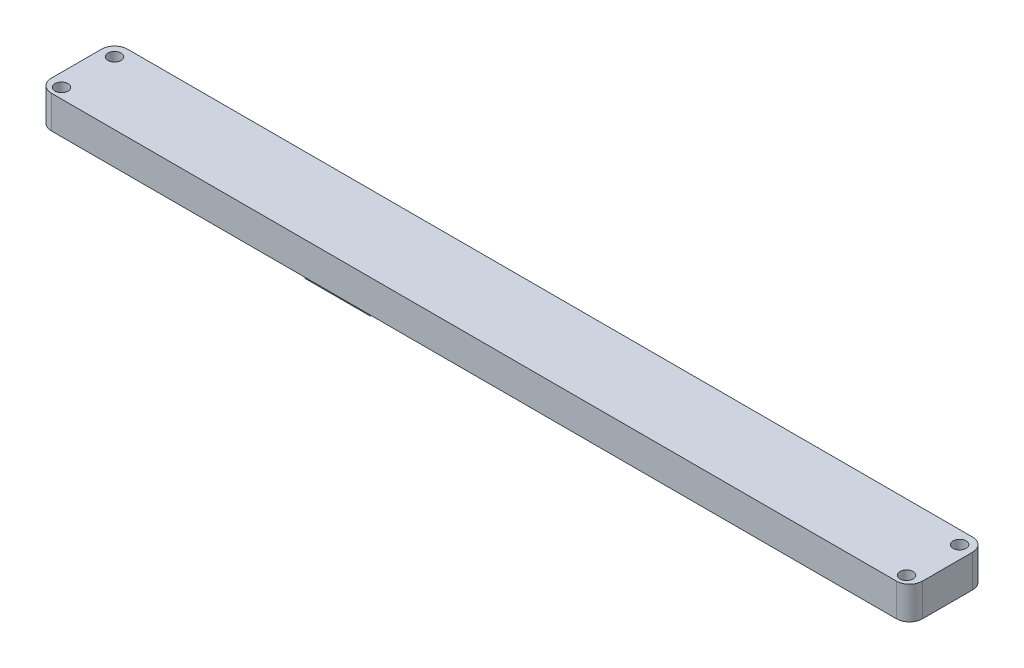
ISO-10303-21;
HEADER;
FILE_DESCRIPTION(('STEP AP214'),'2;1');
FILE_NAME('part.step','',(''),(''),'','','');
FILE_SCHEMA(('AUTOMOTIVE_DESIGN { 1 0 10303 214 1 1 1 1 }'));
ENDSEC;
DATA;
#1=APPLICATION_CONTEXT('core data for automotive mechanical design processes');
#2=APPLICATION_PROTOCOL_DEFINITION('international standard','automotive_design',2000,#1);
#3=PRODUCT_CONTEXT('',#1,'mechanical');
#4=PRODUCT('Part','Part','',(#3));
#5=PRODUCT_RELATED_PRODUCT_CATEGORY('part','',(#4));
#6=PRODUCT_DEFINITION_FORMATION('','',#4);
#7=PRODUCT_DEFINITION_CONTEXT('part definition',#1,'design');
#8=PRODUCT_DEFINITION('design','',#6,#7);
#9=PRODUCT_DEFINITION_SHAPE('','',#8);
#10=(LENGTH_UNIT() NAMED_UNIT(*) SI_UNIT(.MILLI.,.METRE.));
#11=(NAMED_UNIT(*) PLANE_ANGLE_UNIT() SI_UNIT($,.RADIAN.));
#12=(NAMED_UNIT(*) SI_UNIT($,.STERADIAN.) SOLID_ANGLE_UNIT());
#13=UNCERTAINTY_MEASURE_WITH_UNIT(LENGTH_MEASURE(1.E-05),#10,'distance_accuracy_value','');
#14=(GEOMETRIC_REPRESENTATION_CONTEXT(3) GLOBAL_UNCERTAINTY_ASSIGNED_CONTEXT((#13)) GLOBAL_UNIT_ASSIGNED_CONTEXT((#10,
#11,#12)) REPRESENTATION_CONTEXT('',''));
#15=CARTESIAN_POINT('',(0.,0.,0.));
#16=DIRECTION('',(0.,0.,1.));
#17=DIRECTION('',(1.,0.,0.));
#18=AXIS2_PLACEMENT_3D('',#15,#16,#17);
#19=CARTESIAN_POINT('',(194.,0.,-11.5));
#20=DIRECTION('',(0.,-1.,0.));
#21=DIRECTION('',(0.,0.,-1.));
#22=AXIS2_PLACEMENT_3D('',#19,#20,#21);
#23=PLANE('',#22);
#24=CARTESIAN_POINT('',(-194.,0.,12.8432745424898));
#25=DIRECTION('',(0.,1.,0.));
#26=DIRECTION('',(0.,0.,1.));
#27=AXIS2_PLACEMENT_3D('',#24,#25,#26);
#28=CIRCLE('',#27,2.99999999999999);
#29=CARTESIAN_POINT('',(-194.,0.,15.8432745424898));
#30=VERTEX_POINT('',#29);
#31=EDGE_CURVE('E206',#30,#30,#28,.T.);
#32=ORIENTED_EDGE('',*,*,#31,.T.);
#33=EDGE_LOOP('',(#32));
#34=FACE_BOUND('',#33,.T.);
#35=CARTESIAN_POINT('',(194.,0.,-11.5));
#36=DIRECTION('',(0.,1.,0.));
#37=DIRECTION('',(0.,0.,1.));
#38=AXIS2_PLACEMENT_3D('',#35,#36,#37);
#39=CIRCLE('',#38,2.99999999999999);
#40=CARTESIAN_POINT('',(194.,0.,-8.50000000000001));
#41=VERTEX_POINT('',#40);
#42=EDGE_CURVE('E212',#41,#41,#39,.T.);
#43=ORIENTED_EDGE('',*,*,#42,.T.);
#44=EDGE_LOOP('',(#43));
#45=FACE_BOUND('',#44,.T.);
#46=CARTESIAN_POINT('',(194.,0.,-11.5));
#47=DIRECTION('',(0.,1.,0.));
#48=DIRECTION('',(0.,0.,-1.));
#49=AXIS2_PLACEMENT_3D('',#46,#47,#48);
#50=CIRCLE('',#49,6.);
#51=CARTESIAN_POINT('',(200.,0.,-11.5));
#52=VERTEX_POINT('',#51);
#53=CARTESIAN_POINT('',(194.,0.,-17.5));
#54=VERTEX_POINT('',#53);
#55=EDGE_CURVE('E215',#52,#54,#50,.T.);
#56=ORIENTED_EDGE('',*,*,#55,.F.);
#57=DIRECTION('',(0.,0.,-1.));
#58=VECTOR('',#57,1.);
#59=CARTESIAN_POINT('',(200.,0.,11.5));
#60=LINE('',#59,#58);
#61=CARTESIAN_POINT('',(200.,0.,11.5));
#62=VERTEX_POINT('',#61);
#63=EDGE_CURVE('E153',#62,#52,#60,.T.);
#64=ORIENTED_EDGE('',*,*,#63,.F.);
#65=CARTESIAN_POINT('',(194.,0.,11.5));
#66=DIRECTION('',(0.,1.,0.));
#67=DIRECTION('',(0.,0.,1.));
#68=AXIS2_PLACEMENT_3D('',#65,#66,#67);
#69=CIRCLE('',#68,6.);
#70=CARTESIAN_POINT('',(194.,0.,17.5));
#71=VERTEX_POINT('',#70);
#72=EDGE_CURVE('E159',#71,#62,#69,.T.);
#73=ORIENTED_EDGE('',*,*,#72,.F.);
#74=DIRECTION('',(1.,0.,0.));
#75=VECTOR('',#74,1.);
#76=CARTESIAN_POINT('',(-194.,0.,17.5));
#77=LINE('',#76,#75);
#78=CARTESIAN_POINT('',(-194.,0.,17.5));
#79=VERTEX_POINT('',#78);
#80=EDGE_CURVE('E229',#79,#71,#77,.T.);
#81=ORIENTED_EDGE('',*,*,#80,.F.);
#82=CARTESIAN_POINT('',(-194.,0.,11.5));
#83=DIRECTION('',(0.,1.,0.));
#84=DIRECTION('',(0.,0.,-1.));
#85=AXIS2_PLACEMENT_3D('',#82,#83,#84);
#86=CIRCLE('',#85,6.);
#87=CARTESIAN_POINT('',(-200.,0.,11.5));
#88=VERTEX_POINT('',#87);
#89=EDGE_CURVE('E226',#88,#79,#86,.T.);
#90=ORIENTED_EDGE('',*,*,#89,.F.);
#91=DIRECTION('',(0.,0.,1.));
#92=VECTOR('',#91,1.);
#93=CARTESIAN_POINT('',(-200.,0.,11.5));
#94=LINE('',#93,#92);
#95=CARTESIAN_POINT('',(-200.,0.,-11.5));
#96=VERTEX_POINT('',#95);
#97=EDGE_CURVE('E223',#96,#88,#94,.T.);
#98=ORIENTED_EDGE('',*,*,#97,.F.);
#99=CARTESIAN_POINT('',(-194.,0.,-11.5));
#100=DIRECTION('',(0.,1.,0.));
#101=DIRECTION('',(0.,0.,-1.));
#102=AXIS2_PLACEMENT_3D('',#99,#100,#101);
#103=CIRCLE('',#102,6.);
#104=CARTESIAN_POINT('',(-194.,0.,-17.5));
#105=VERTEX_POINT('',#104);
#106=EDGE_CURVE('E220',#105,#96,#103,.T.);
#107=ORIENTED_EDGE('',*,*,#106,.F.);
#108=DIRECTION('',(-1.,0.,0.));
#109=VECTOR('',#108,1.);
#110=CARTESIAN_POINT('',(-194.,0.,-17.5));
#111=LINE('',#110,#109);
#112=EDGE_CURVE('E217',#54,#105,#111,.T.);
#113=ORIENTED_EDGE('',*,*,#112,.F.);
#114=EDGE_LOOP('',(#56,#64,#73,#81,#90,#98,#107,#113));
#115=FACE_BOUND('',#114,.T.);
#116=CARTESIAN_POINT('',(194.,0.,12.8432745424898));
#117=DIRECTION('',(0.,1.,0.));
#118=DIRECTION('',(0.,0.,1.));
#119=AXIS2_PLACEMENT_3D('',#116,#117,#118);
#120=CIRCLE('',#119,2.99999999999999);
#121=CARTESIAN_POINT('',(194.,0.,15.8432745424898));
#122=VERTEX_POINT('',#121);
#123=EDGE_CURVE('E209',#122,#122,#120,.T.);
#124=ORIENTED_EDGE('',*,*,#123,.T.);
#125=EDGE_LOOP('',(#124));
#126=FACE_BOUND('',#125,.T.);
#127=CARTESIAN_POINT('',(-194.,0.,-11.5));
#128=DIRECTION('',(0.,1.,0.));
#129=DIRECTION('',(0.,0.,1.));
#130=AXIS2_PLACEMENT_3D('',#127,#128,#129);
#131=CIRCLE('',#130,2.99999999999999);
#132=CARTESIAN_POINT('',(-194.,0.,-8.50000000000001));
#133=VERTEX_POINT('',#132);
#134=EDGE_CURVE('E203',#133,#133,#131,.T.);
#135=ORIENTED_EDGE('',*,*,#134,.T.);
#136=EDGE_LOOP('',(#135));
#137=FACE_BOUND('',#136,.T.);
#138=DIRECTION('',(1.,0.,0.));
#139=VECTOR('',#138,1.);
#140=CARTESIAN_POINT('',(-83.0933507684873,0.,-13.0826787847727));
#141=LINE('',#140,#139);
#142=CARTESIAN_POINT('',(-92.258502158399,0.,-13.0826787847727));
#143=VERTEX_POINT('',#142);
#144=CARTESIAN_POINT('',(-43.9281993785756,0.,-13.0826787847727));
#145=VERTEX_POINT('',#144);
#146=EDGE_CURVE('E69',#143,#145,#141,.T.);
#147=ORIENTED_EDGE('',*,*,#146,.F.);
#148=DIRECTION('',(0.,0.,1.));
#149=VECTOR('',#148,1.);
#150=CARTESIAN_POINT('',(-92.258502158399,0.,11.9173212152273));
#151=LINE('',#150,#149);
#152=CARTESIAN_POINT('',(-92.258502158399,0.,11.9173212152273));
#153=VERTEX_POINT('',#152);
#154=EDGE_CURVE('E175',#143,#153,#151,.T.);
#155=ORIENTED_EDGE('',*,*,#154,.T.);
#156=DIRECTION('',(-1.,0.,0.));
#157=VECTOR('',#156,1.);
#158=CARTESIAN_POINT('',(-83.0933507684873,0.,11.9173212152273));
#159=LINE('',#158,#157);
#160=CARTESIAN_POINT('',(-43.9281993785756,0.,11.9173212152273));
#161=VERTEX_POINT('',#160);
#162=EDGE_CURVE('E186',#161,#153,#159,.T.);
#163=ORIENTED_EDGE('',*,*,#162,.F.);
#164=DIRECTION('',(0.,0.,-1.));
#165=VECTOR('',#164,1.);
#166=CARTESIAN_POINT('',(-43.9281993785756,0.,-13.0826787847727));
#167=LINE('',#166,#165);
#168=EDGE_CURVE('E173',#161,#145,#167,.T.);
#169=ORIENTED_EDGE('',*,*,#168,.T.);
#170=EDGE_LOOP('',(#147,#155,#163,#169));
#171=FACE_BOUND('',#170,.T.);
#172=ADVANCED_FACE('F45',(#34,#45,#115,#126,#137,#171),#23,.T.);
#173=CARTESIAN_POINT('',(194.,36.,-11.5));
#174=DIRECTION('',(0.,-1.,0.));
#175=DIRECTION('',(0.,0.,-1.));
#176=AXIS2_PLACEMENT_3D('',#173,#174,#175);
#177=CYLINDRICAL_SURFACE('',#176,6.);
#178=DIRECTION('',(0.,-1.,0.));
#179=VECTOR('',#178,1.);
#180=CARTESIAN_POINT('',(194.,36.,-17.5));
#181=LINE('',#180,#179);
#182=CARTESIAN_POINT('',(194.,15.,-17.5));
#183=VERTEX_POINT('',#182);
#184=EDGE_CURVE('E148',#183,#54,#181,.T.);
#185=ORIENTED_EDGE('',*,*,#184,.F.);
#186=CARTESIAN_POINT('',(194.,15.,-11.5));
#187=DIRECTION('',(0.,-1.,0.));
#188=DIRECTION('',(0.,0.,-1.));
#189=AXIS2_PLACEMENT_3D('',#186,#187,#188);
#190=CIRCLE('',#189,6.);
#191=CARTESIAN_POINT('',(200.,15.,-11.5));
#192=VERTEX_POINT('',#191);
#193=EDGE_CURVE('E135',#183,#192,#190,.T.);
#194=ORIENTED_EDGE('',*,*,#193,.T.);
#195=DIRECTION('',(0.,-1.,0.));
#196=VECTOR('',#195,1.);
#197=CARTESIAN_POINT('',(200.,36.,-11.5));
#198=LINE('',#197,#196);
#199=EDGE_CURVE('E146',#192,#52,#198,.T.);
#200=ORIENTED_EDGE('',*,*,#199,.T.);
#201=ORIENTED_EDGE('',*,*,#55,.T.);
#202=EDGE_LOOP('',(#185,#194,#200,#201));
#203=FACE_BOUND('',#202,.T.);
#204=ADVANCED_FACE('F144',(#203),#177,.T.);
#205=CARTESIAN_POINT('',(-194.,36.,-17.5));
#206=DIRECTION('',(0.,0.,1.));
#207=DIRECTION('',(1.,0.,0.));
#208=AXIS2_PLACEMENT_3D('',#205,#206,#207);
#209=PLANE('',#208);
#210=DIRECTION('',(0.,-1.,0.));
#211=VECTOR('',#210,1.);
#212=CARTESIAN_POINT('',(-194.,36.,-17.5));
#213=LINE('',#212,#211);
#214=CARTESIAN_POINT('',(-194.,15.,-17.5));
#215=VERTEX_POINT('',#214);
#216=EDGE_CURVE('E170',#215,#105,#213,.T.);
#217=ORIENTED_EDGE('',*,*,#216,.F.);
#218=DIRECTION('',(1.,0.,0.));
#219=VECTOR('',#218,1.);
#220=CARTESIAN_POINT('',(-194.,15.,-17.5));
#221=LINE('',#220,#219);
#222=EDGE_CURVE('E149',#215,#183,#221,.T.);
#223=ORIENTED_EDGE('',*,*,#222,.T.);
#224=ORIENTED_EDGE('',*,*,#184,.T.);
#225=ORIENTED_EDGE('',*,*,#112,.T.);
#226=EDGE_LOOP('',(#217,#223,#224,#225));
#227=FACE_BOUND('',#226,.T.);
#228=ADVANCED_FACE('F244',(#227),#209,.F.);
#229=CARTESIAN_POINT('',(-194.,36.,-11.5));
#230=DIRECTION('',(0.,-1.,0.));
#231=DIRECTION('',(0.,0.,-1.));
#232=AXIS2_PLACEMENT_3D('',#229,#230,#231);
#233=CYLINDRICAL_SURFACE('',#232,6.);
#234=DIRECTION('',(0.,-1.,0.));
#235=VECTOR('',#234,1.);
#236=CARTESIAN_POINT('',(-200.,36.,-11.5));
#237=LINE('',#236,#235);
#238=CARTESIAN_POINT('',(-200.,15.,-11.5));
#239=VERTEX_POINT('',#238);
#240=EDGE_CURVE('E168',#239,#96,#237,.T.);
#241=ORIENTED_EDGE('',*,*,#240,.F.);
#242=CARTESIAN_POINT('',(-194.,15.,-11.5));
#243=DIRECTION('',(0.,-1.,0.));
#244=DIRECTION('',(0.,0.,-1.));
#245=AXIS2_PLACEMENT_3D('',#242,#243,#244);
#246=CIRCLE('',#245,6.);
#247=EDGE_CURVE('E246',#239,#215,#246,.T.);
#248=ORIENTED_EDGE('',*,*,#247,.T.);
#249=ORIENTED_EDGE('',*,*,#216,.T.);
#250=ORIENTED_EDGE('',*,*,#106,.T.);
#251=EDGE_LOOP('',(#241,#248,#249,#250));
#252=FACE_BOUND('',#251,.T.);
#253=ADVANCED_FACE('F301',(#252),#233,.T.);
#254=CARTESIAN_POINT('',(-200.,36.,11.5));
#255=DIRECTION('',(1.,0.,0.));
#256=DIRECTION('',(0.,0.,-1.));
#257=AXIS2_PLACEMENT_3D('',#254,#255,#256);
#258=PLANE('',#257);
#259=DIRECTION('',(0.,-1.,0.));
#260=VECTOR('',#259,1.);
#261=CARTESIAN_POINT('',(-200.,36.,11.5));
#262=LINE('',#261,#260);
#263=CARTESIAN_POINT('',(-200.,15.,11.5));
#264=VERTEX_POINT('',#263);
#265=EDGE_CURVE('E166',#264,#88,#262,.T.);
#266=ORIENTED_EDGE('',*,*,#265,.F.);
#267=DIRECTION('',(0.,0.,-1.));
#268=VECTOR('',#267,1.);
#269=CARTESIAN_POINT('',(-200.,15.,11.5));
#270=LINE('',#269,#268);
#271=EDGE_CURVE('E248',#264,#239,#270,.T.);
#272=ORIENTED_EDGE('',*,*,#271,.T.);
#273=ORIENTED_EDGE('',*,*,#240,.T.);
#274=ORIENTED_EDGE('',*,*,#97,.T.);
#275=EDGE_LOOP('',(#266,#272,#273,#274));
#276=FACE_BOUND('',#275,.T.);
#277=ADVANCED_FACE('F297',(#276),#258,.F.);
#278=CARTESIAN_POINT('',(-194.,36.,11.5));
#279=DIRECTION('',(0.,-1.,0.));
#280=DIRECTION('',(0.,0.,-1.));
#281=AXIS2_PLACEMENT_3D('',#278,#279,#280);
#282=CYLINDRICAL_SURFACE('',#281,6.);
#283=DIRECTION('',(0.,-1.,0.));
#284=VECTOR('',#283,1.);
#285=CARTESIAN_POINT('',(-194.,36.,17.5));
#286=LINE('',#285,#284);
#287=CARTESIAN_POINT('',(-194.,15.,17.5));
#288=VERTEX_POINT('',#287);
#289=EDGE_CURVE('E164',#288,#79,#286,.T.);
#290=ORIENTED_EDGE('',*,*,#289,.F.);
#291=CARTESIAN_POINT('',(-194.,15.,11.5));
#292=DIRECTION('',(0.,-1.,0.));
#293=DIRECTION('',(0.,0.,-1.));
#294=AXIS2_PLACEMENT_3D('',#291,#292,#293);
#295=CIRCLE('',#294,6.);
#296=EDGE_CURVE('E342',#288,#264,#295,.T.);
#297=ORIENTED_EDGE('',*,*,#296,.T.);
#298=ORIENTED_EDGE('',*,*,#265,.T.);
#299=ORIENTED_EDGE('',*,*,#89,.T.);
#300=EDGE_LOOP('',(#290,#297,#298,#299));
#301=FACE_BOUND('',#300,.T.);
#302=ADVANCED_FACE('F293',(#301),#282,.T.);
#303=CARTESIAN_POINT('',(-194.,36.,17.5));
#304=DIRECTION('',(0.,0.,-1.));
#305=DIRECTION('',(-1.,0.,0.));
#306=AXIS2_PLACEMENT_3D('',#303,#304,#305);
#307=PLANE('',#306);
#308=DIRECTION('',(0.,-1.,0.));
#309=VECTOR('',#308,1.);
#310=CARTESIAN_POINT('',(194.,36.,17.5));
#311=LINE('',#310,#309);
#312=CARTESIAN_POINT('',(194.,15.,17.5));
#313=VERTEX_POINT('',#312);
#314=EDGE_CURVE('E157',#313,#71,#311,.T.);
#315=ORIENTED_EDGE('',*,*,#314,.F.);
#316=DIRECTION('',(-1.,0.,0.));
#317=VECTOR('',#316,1.);
#318=CARTESIAN_POINT('',(-194.,15.,17.5));
#319=LINE('',#318,#317);
#320=EDGE_CURVE('E339',#313,#288,#319,.T.);
#321=ORIENTED_EDGE('',*,*,#320,.T.);
#322=ORIENTED_EDGE('',*,*,#289,.T.);
#323=ORIENTED_EDGE('',*,*,#80,.T.);
#324=EDGE_LOOP('',(#315,#321,#322,#323));
#325=FACE_BOUND('',#324,.T.);
#326=ADVANCED_FACE('F290',(#325),#307,.F.);
#327=CARTESIAN_POINT('',(194.,36.,11.5));
#328=DIRECTION('',(0.,-1.,0.));
#329=DIRECTION('',(0.,0.,-1.));
#330=AXIS2_PLACEMENT_3D('',#327,#328,#329);
#331=CYLINDRICAL_SURFACE('',#330,6.);
#332=DIRECTION('',(0.,-1.,0.));
#333=VECTOR('',#332,1.);
#334=CARTESIAN_POINT('',(200.,36.,11.5));
#335=LINE('',#334,#333);
#336=CARTESIAN_POINT('',(200.,15.,11.5));
#337=VERTEX_POINT('',#336);
#338=EDGE_CURVE('E155',#337,#62,#335,.T.);
#339=ORIENTED_EDGE('',*,*,#338,.F.);
#340=CARTESIAN_POINT('',(194.,15.,11.5));
#341=DIRECTION('',(0.,-1.,0.));
#342=DIRECTION('',(0.,0.,-1.));
#343=AXIS2_PLACEMENT_3D('',#340,#341,#342);
#344=CIRCLE('',#343,6.);
#345=EDGE_CURVE('E61',#337,#313,#344,.T.);
#346=ORIENTED_EDGE('',*,*,#345,.T.);
#347=ORIENTED_EDGE('',*,*,#314,.T.);
#348=ORIENTED_EDGE('',*,*,#72,.T.);
#349=EDGE_LOOP('',(#339,#346,#347,#348));
#350=FACE_BOUND('',#349,.T.);
#351=ADVANCED_FACE('F234',(#350),#331,.T.);
#352=CARTESIAN_POINT('',(200.,36.,11.5));
#353=DIRECTION('',(-1.,0.,0.));
#354=DIRECTION('',(0.,0.,1.));
#355=AXIS2_PLACEMENT_3D('',#352,#353,#354);
#356=PLANE('',#355);
#357=ORIENTED_EDGE('',*,*,#199,.F.);
#358=DIRECTION('',(0.,0.,1.));
#359=VECTOR('',#358,1.);
#360=CARTESIAN_POINT('',(200.,15.,11.5));
#361=LINE('',#360,#359);
#362=EDGE_CURVE('E132',#192,#337,#361,.T.);
#363=ORIENTED_EDGE('',*,*,#362,.T.);
#364=ORIENTED_EDGE('',*,*,#338,.T.);
#365=ORIENTED_EDGE('',*,*,#63,.T.);
#366=EDGE_LOOP('',(#357,#363,#364,#365));
#367=FACE_BOUND('',#366,.T.);
#368=ADVANCED_FACE('F151',(#367),#356,.F.);
#369=CARTESIAN_POINT('',(194.,36.,-11.5));
#370=DIRECTION('',(0.,-1.,0.));
#371=DIRECTION('',(0.,0.,-1.));
#372=AXIS2_PLACEMENT_3D('',#369,#370,#371);
#373=CYLINDRICAL_SURFACE('',#372,2.99999999999999);
#374=CARTESIAN_POINT('',(194.,15.,-11.5));
#375=DIRECTION('',(0.,-1.,0.));
#376=DIRECTION('',(0.,0.,-1.));
#377=AXIS2_PLACEMENT_3D('',#374,#375,#376);
#378=CIRCLE('',#377,2.99999999999999);
#379=CARTESIAN_POINT('',(194.,15.,-14.5));
#380=VERTEX_POINT('',#379);
#381=EDGE_CURVE('E140',#380,#380,#378,.T.);
#382=ORIENTED_EDGE('',*,*,#381,.F.);
#383=EDGE_LOOP('',(#382));
#384=FACE_BOUND('',#383,.T.);
#385=ORIENTED_EDGE('',*,*,#42,.F.);
#386=EDGE_LOOP('',(#385));
#387=FACE_BOUND('',#386,.T.);
#388=ADVANCED_FACE('F284',(#384,#387),#373,.F.);
#389=CARTESIAN_POINT('',(194.,36.,12.8432745424898));
#390=DIRECTION('',(0.,-1.,0.));
#391=DIRECTION('',(0.,0.,-1.));
#392=AXIS2_PLACEMENT_3D('',#389,#390,#391);
#393=CYLINDRICAL_SURFACE('',#392,2.99999999999999);
#394=CARTESIAN_POINT('',(194.,15.,12.8432745424898));
#395=DIRECTION('',(0.,-1.,0.));
#396=DIRECTION('',(0.,0.,-1.));
#397=AXIS2_PLACEMENT_3D('',#394,#395,#396);
#398=CIRCLE('',#397,2.99999999999999);
#399=CARTESIAN_POINT('',(194.,15.,9.84327454248977));
#400=VERTEX_POINT('',#399);
#401=EDGE_CURVE('E330',#400,#400,#398,.T.);
#402=ORIENTED_EDGE('',*,*,#401,.F.);
#403=EDGE_LOOP('',(#402));
#404=FACE_BOUND('',#403,.T.);
#405=ORIENTED_EDGE('',*,*,#123,.F.);
#406=EDGE_LOOP('',(#405));
#407=FACE_BOUND('',#406,.T.);
#408=ADVANCED_FACE('F351',(#404,#407),#393,.F.);
#409=CARTESIAN_POINT('',(-194.,36.,12.8432745424898));
#410=DIRECTION('',(0.,-1.,0.));
#411=DIRECTION('',(0.,0.,-1.));
#412=AXIS2_PLACEMENT_3D('',#409,#410,#411);
#413=CYLINDRICAL_SURFACE('',#412,2.99999999999999);
#414=CARTESIAN_POINT('',(-194.,15.,12.8432745424898));
#415=DIRECTION('',(0.,-1.,0.));
#416=DIRECTION('',(0.,0.,-1.));
#417=AXIS2_PLACEMENT_3D('',#414,#415,#416);
#418=CIRCLE('',#417,2.99999999999999);
#419=CARTESIAN_POINT('',(-194.,15.,9.84327454248977));
#420=VERTEX_POINT('',#419);
#421=EDGE_CURVE('E326',#420,#420,#418,.T.);
#422=ORIENTED_EDGE('',*,*,#421,.F.);
#423=EDGE_LOOP('',(#422));
#424=FACE_BOUND('',#423,.T.);
#425=ORIENTED_EDGE('',*,*,#31,.F.);
#426=EDGE_LOOP('',(#425));
#427=FACE_BOUND('',#426,.T.);
#428=ADVANCED_FACE('F271',(#424,#427),#413,.F.);
#429=CARTESIAN_POINT('',(-194.,36.,-11.5));
#430=DIRECTION('',(0.,-1.,0.));
#431=DIRECTION('',(0.,0.,-1.));
#432=AXIS2_PLACEMENT_3D('',#429,#430,#431);
#433=CYLINDRICAL_SURFACE('',#432,2.99999999999999);
#434=CARTESIAN_POINT('',(-194.,15.,-11.5));
#435=DIRECTION('',(0.,-1.,0.));
#436=DIRECTION('',(0.,0.,-1.));
#437=AXIS2_PLACEMENT_3D('',#434,#435,#436);
#438=CIRCLE('',#437,2.99999999999999);
#439=CARTESIAN_POINT('',(-194.,15.,-14.5));
#440=VERTEX_POINT('',#439);
#441=EDGE_CURVE('E49',#440,#440,#438,.T.);
#442=ORIENTED_EDGE('',*,*,#441,.F.);
#443=EDGE_LOOP('',(#442));
#444=FACE_BOUND('',#443,.T.);
#445=ORIENTED_EDGE('',*,*,#134,.F.);
#446=EDGE_LOOP('',(#445));
#447=FACE_BOUND('',#446,.T.);
#448=ADVANCED_FACE('F264',(#444,#447),#433,.F.);
#449=CARTESIAN_POINT('',(-83.0933507684873,-6.,-13.0826787847727));
#450=DIRECTION('',(0.,0.,1.));
#451=DIRECTION('',(1.,0.,0.));
#452=AXIS2_PLACEMENT_3D('',#449,#450,#451);
#453=PLANE('',#452);
#454=ORIENTED_EDGE('',*,*,#146,.T.);
#455=CARTESIAN_POINT('',(-43.9281993785756,-10.,-13.0826787847727));
#456=DIRECTION('',(0.,0.,1.));
#457=DIRECTION('',(1.,0.,0.));
#458=AXIS2_PLACEMENT_3D('',#455,#456,#457);
#459=CIRCLE('',#458,10.);
#460=CARTESIAN_POINT('',(-53.0933507684873,-6.,-13.0826787847727));
#461=VERTEX_POINT('',#460);
#462=EDGE_CURVE('E14',#145,#461,#459,.T.);
#463=ORIENTED_EDGE('',*,*,#462,.T.);
#464=DIRECTION('',(1.,0.,0.));
#465=VECTOR('',#464,1.);
#466=CARTESIAN_POINT('',(-83.0933507684873,-6.,-13.0826787847727));
#467=LINE('',#466,#465);
#468=CARTESIAN_POINT('',(-83.0933507684873,-6.,-13.0826787847727));
#469=VERTEX_POINT('',#468);
#470=EDGE_CURVE('E198',#469,#461,#467,.T.);
#471=ORIENTED_EDGE('',*,*,#470,.F.);
#472=CARTESIAN_POINT('',(-92.258502158399,-10.,-13.0826787847727));
#473=DIRECTION('',(0.,0.,1.));
#474=DIRECTION('',(1.,0.,0.));
#475=AXIS2_PLACEMENT_3D('',#472,#473,#474);
#476=CIRCLE('',#475,10.);
#477=EDGE_CURVE('E177',#469,#143,#476,.T.);
#478=ORIENTED_EDGE('',*,*,#477,.T.);
#479=EDGE_LOOP('',(#454,#463,#471,#478));
#480=FACE_BOUND('',#479,.T.);
#481=ADVANCED_FACE('F262',(#480),#453,.F.);
#482=CARTESIAN_POINT('',(-83.0933507684873,-6.,11.9173212152273));
#483=DIRECTION('',(0.,0.,-1.));
#484=DIRECTION('',(-1.,0.,0.));
#485=AXIS2_PLACEMENT_3D('',#482,#483,#484);
#486=PLANE('',#485);
#487=ORIENTED_EDGE('',*,*,#162,.T.);
#488=CARTESIAN_POINT('',(-92.258502158399,-10.,11.9173212152273));
#489=DIRECTION('',(0.,0.,-1.));
#490=DIRECTION('',(-1.,0.,0.));
#491=AXIS2_PLACEMENT_3D('',#488,#489,#490);
#492=CIRCLE('',#491,10.);
#493=CARTESIAN_POINT('',(-83.0933507684873,-6.,11.9173212152273));
#494=VERTEX_POINT('',#493);
#495=EDGE_CURVE('E179',#153,#494,#492,.T.);
#496=ORIENTED_EDGE('',*,*,#495,.T.);
#497=DIRECTION('',(-1.,0.,0.));
#498=VECTOR('',#497,1.);
#499=CARTESIAN_POINT('',(-83.0933507684873,-6.,11.9173212152273));
#500=LINE('',#499,#498);
#501=CARTESIAN_POINT('',(-53.0933507684873,-6.,11.9173212152273));
#502=VERTEX_POINT('',#501);
#503=EDGE_CURVE('E188',#502,#494,#500,.T.);
#504=ORIENTED_EDGE('',*,*,#503,.F.);
#505=CARTESIAN_POINT('',(-43.9281993785756,-10.,11.9173212152273));
#506=DIRECTION('',(0.,0.,-1.));
#507=DIRECTION('',(-1.,0.,0.));
#508=AXIS2_PLACEMENT_3D('',#505,#506,#507);
#509=CIRCLE('',#508,10.);
#510=EDGE_CURVE('E54',#502,#161,#509,.T.);
#511=ORIENTED_EDGE('',*,*,#510,.T.);
#512=EDGE_LOOP('',(#487,#496,#504,#511));
#513=FACE_BOUND('',#512,.T.);
#514=ADVANCED_FACE('F185',(#513),#486,.F.);
#515=CARTESIAN_POINT('',(0.,-6.,0.));
#516=DIRECTION('',(0.,-1.,0.));
#517=DIRECTION('',(0.,0.,-1.));
#518=AXIS2_PLACEMENT_3D('',#515,#516,#517);
#519=PLANE('',#518);
#520=DIRECTION('',(0.,0.,-1.));
#521=VECTOR('',#520,1.);
#522=CARTESIAN_POINT('',(-83.0933507684873,-6.,11.9173212152273));
#523=LINE('',#522,#521);
#524=EDGE_CURVE('E195',#494,#469,#523,.T.);
#525=ORIENTED_EDGE('',*,*,#524,.T.);
#526=ORIENTED_EDGE('',*,*,#470,.T.);
#527=DIRECTION('',(0.,0.,1.));
#528=VECTOR('',#527,1.);
#529=CARTESIAN_POINT('',(-53.0933507684873,-6.,11.9173212152273));
#530=LINE('',#529,#528);
#531=EDGE_CURVE('E254',#461,#502,#530,.T.);
#532=ORIENTED_EDGE('',*,*,#531,.T.);
#533=ORIENTED_EDGE('',*,*,#503,.T.);
#534=EDGE_LOOP('',(#525,#526,#532,#533));
#535=FACE_BOUND('',#534,.T.);
#536=ADVANCED_FACE('F257',(#535),#519,.T.);
#537=CARTESIAN_POINT('',(-92.258502158399,-10.,11.9173212152273));
#538=DIRECTION('',(0.,0.,-1.));
#539=DIRECTION('',(-1.,0.,0.));
#540=AXIS2_PLACEMENT_3D('',#537,#538,#539);
#541=CYLINDRICAL_SURFACE('',#540,10.);
#542=ORIENTED_EDGE('',*,*,#495,.F.);
#543=ORIENTED_EDGE('',*,*,#154,.F.);
#544=ORIENTED_EDGE('',*,*,#477,.F.);
#545=ORIENTED_EDGE('',*,*,#524,.F.);
#546=EDGE_LOOP('',(#542,#543,#544,#545));
#547=FACE_BOUND('',#546,.T.);
#548=ADVANCED_FACE('F259',(#547),#541,.F.);
#549=CARTESIAN_POINT('',(-43.9281993785756,-10.,11.9173212152273));
#550=DIRECTION('',(0.,0.,1.));
#551=DIRECTION('',(1.,0.,0.));
#552=AXIS2_PLACEMENT_3D('',#549,#550,#551);
#553=CYLINDRICAL_SURFACE('',#552,10.);
#554=ORIENTED_EDGE('',*,*,#462,.F.);
#555=ORIENTED_EDGE('',*,*,#168,.F.);
#556=ORIENTED_EDGE('',*,*,#510,.F.);
#557=ORIENTED_EDGE('',*,*,#531,.F.);
#558=EDGE_LOOP('',(#554,#555,#556,#557));
#559=FACE_BOUND('',#558,.T.);
#560=ADVANCED_FACE('F47',(#559),#553,.F.);
#561=CARTESIAN_POINT('',(0.,15.,0.));
#562=DIRECTION('',(0.,-1.,0.));
#563=DIRECTION('',(0.,0.,-1.));
#564=AXIS2_PLACEMENT_3D('',#561,#562,#563);
#565=PLANE('',#564);
#566=ORIENTED_EDGE('',*,*,#441,.T.);
#567=EDGE_LOOP('',(#566));
#568=FACE_BOUND('',#567,.T.);
#569=ORIENTED_EDGE('',*,*,#421,.T.);
#570=EDGE_LOOP('',(#569));
#571=FACE_BOUND('',#570,.T.);
#572=ORIENTED_EDGE('',*,*,#401,.T.);
#573=EDGE_LOOP('',(#572));
#574=FACE_BOUND('',#573,.T.);
#575=ORIENTED_EDGE('',*,*,#381,.T.);
#576=EDGE_LOOP('',(#575));
#577=FACE_BOUND('',#576,.T.);
#578=ORIENTED_EDGE('',*,*,#222,.F.);
#579=ORIENTED_EDGE('',*,*,#247,.F.);
#580=ORIENTED_EDGE('',*,*,#271,.F.);
#581=ORIENTED_EDGE('',*,*,#296,.F.);
#582=ORIENTED_EDGE('',*,*,#320,.F.);
#583=ORIENTED_EDGE('',*,*,#345,.F.);
#584=ORIENTED_EDGE('',*,*,#362,.F.);
#585=ORIENTED_EDGE('',*,*,#193,.F.);
#586=EDGE_LOOP('',(#578,#579,#580,#581,#582,#583,#584,#585));
#587=FACE_BOUND('',#586,.T.);
#588=ADVANCED_FACE('F134',(#568,#571,#574,#577,#587),#565,.F.);
#589=CLOSED_SHELL('',(#172,#204,#228,#253,#277,#302,#326,#351,#368,#388,#408,#428,#448,#481,
#514,#536,#548,#560,#588));
#590=MANIFOLD_SOLID_BREP('B2',#589);
#591=ADVANCED_BREP_SHAPE_REPRESENTATION('',(#18,#590),#14);
#592=SHAPE_DEFINITION_REPRESENTATION(#9,#591);
ENDSEC;
END-ISO-10303-21;
